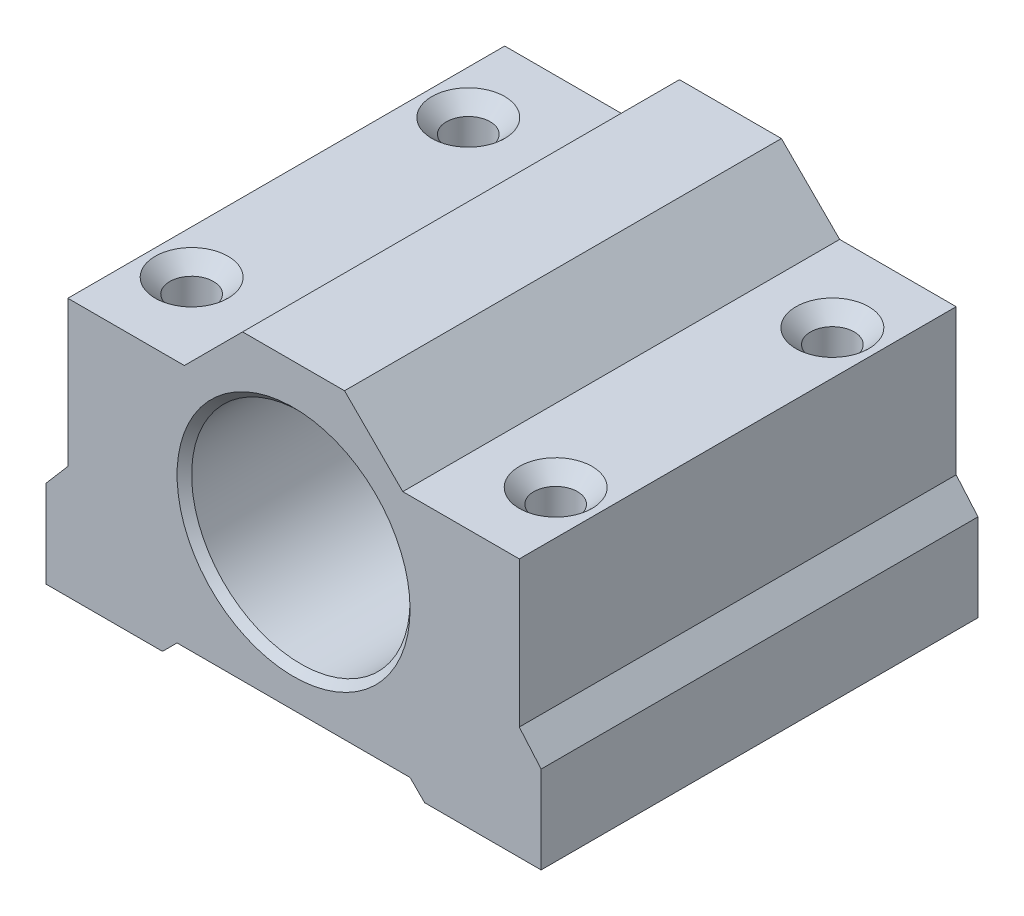
ISO-10303-21;
HEADER;
FILE_DESCRIPTION(('STEP AP214'),'2;1');
FILE_NAME('part.step','',(''),(''),'','','');
FILE_SCHEMA(('AUTOMOTIVE_DESIGN { 1 0 10303 214 1 1 1 1 }'));
ENDSEC;
DATA;
#1=APPLICATION_CONTEXT('core data for automotive mechanical design processes');
#2=APPLICATION_PROTOCOL_DEFINITION('international standard','automotive_design',2000,#1);
#3=PRODUCT_CONTEXT('',#1,'mechanical');
#4=PRODUCT('Part','Part','',(#3));
#5=PRODUCT_RELATED_PRODUCT_CATEGORY('part','',(#4));
#6=PRODUCT_DEFINITION_FORMATION('','',#4);
#7=PRODUCT_DEFINITION_CONTEXT('part definition',#1,'design');
#8=PRODUCT_DEFINITION('design','',#6,#7);
#9=PRODUCT_DEFINITION_SHAPE('','',#8);
#10=(LENGTH_UNIT() NAMED_UNIT(*) SI_UNIT(.MILLI.,.METRE.));
#11=(NAMED_UNIT(*) PLANE_ANGLE_UNIT() SI_UNIT($,.RADIAN.));
#12=(NAMED_UNIT(*) SI_UNIT($,.STERADIAN.) SOLID_ANGLE_UNIT());
#13=UNCERTAINTY_MEASURE_WITH_UNIT(LENGTH_MEASURE(1.E-05),#10,'distance_accuracy_value','');
#14=(GEOMETRIC_REPRESENTATION_CONTEXT(3) GLOBAL_UNCERTAINTY_ASSIGNED_CONTEXT((#13)) GLOBAL_UNIT_ASSIGNED_CONTEXT((#10,
#11,#12)) REPRESENTATION_CONTEXT('',''));
#15=CARTESIAN_POINT('',(0.,0.,0.));
#16=DIRECTION('',(0.,0.,1.));
#17=DIRECTION('',(1.,0.,0.));
#18=AXIS2_PLACEMENT_3D('',#15,#16,#17);
#19=CARTESIAN_POINT('',(0.,-3.33066907387547E-13,30.));
#20=DIRECTION('',(0.,0.,-0.999999999999999));
#21=DIRECTION('',(-1.,0.,0.));
#22=AXIS2_PLACEMENT_3D('',#19,#20,#21);
#23=PLANE('',#22);
#24=DIRECTION('',(1.,0.,0.));
#25=VECTOR('',#24,1.);
#26=CARTESIAN_POINT('',(8.00000000000017,0.,30.));
#27=LINE('',#26,#25);
#28=CARTESIAN_POINT('',(0.,-3.33066907387547E-13,30.));
#29=VERTEX_POINT('',#28);
#30=CARTESIAN_POINT('',(8.00000000000017,0.,30.));
#31=VERTEX_POINT('',#30);
#32=EDGE_CURVE('E230',#29,#31,#27,.T.);
#33=ORIENTED_EDGE('',*,*,#32,.T.);
#34=DIRECTION('',(0.707106781186546,0.70710678118655,0.));
#35=VECTOR('',#34,1.);
#36=CARTESIAN_POINT('',(9.00000000000017,0.999999999999834,30.));
#37=LINE('',#36,#35);
#38=CARTESIAN_POINT('',(9.00000000000017,0.999999999999834,30.));
#39=VERTEX_POINT('',#38);
#40=EDGE_CURVE('E138',#31,#39,#37,.T.);
#41=ORIENTED_EDGE('',*,*,#40,.T.);
#42=DIRECTION('',(1.,0.,0.));
#43=VECTOR('',#42,1.);
#44=CARTESIAN_POINT('',(25.0000000000001,0.999999999999945,30.));
#45=LINE('',#44,#43);
#46=CARTESIAN_POINT('',(25.0000000000001,0.999999999999945,30.));
#47=VERTEX_POINT('',#46);
#48=EDGE_CURVE('E269',#39,#47,#45,.T.);
#49=ORIENTED_EDGE('',*,*,#48,.T.);
#50=DIRECTION('',(0.707106781186547,-0.70710678118655,0.));
#51=VECTOR('',#50,1.);
#52=CARTESIAN_POINT('',(25.0000000000001,0.999999999999945,30.));
#53=LINE('',#52,#51);
#54=CARTESIAN_POINT('',(26.0000000000001,0.,30.));
#55=VERTEX_POINT('',#54);
#56=EDGE_CURVE('E287',#47,#55,#53,.T.);
#57=ORIENTED_EDGE('',*,*,#56,.T.);
#58=DIRECTION('',(1.,0.,0.));
#59=VECTOR('',#58,1.);
#60=CARTESIAN_POINT('',(26.0000000000001,0.,30.));
#61=LINE('',#60,#59);
#62=CARTESIAN_POINT('',(33.9999999999999,0.,30.));
#63=VERTEX_POINT('',#62);
#64=EDGE_CURVE('E284',#55,#63,#61,.T.);
#65=ORIENTED_EDGE('',*,*,#64,.T.);
#66=DIRECTION('',(0.,1.,0.));
#67=VECTOR('',#66,1.);
#68=CARTESIAN_POINT('',(33.9999999999999,0.,30.));
#69=LINE('',#68,#67);
#70=CARTESIAN_POINT('',(34.,6.00000000000006,30.));
#71=VERTEX_POINT('',#70);
#72=EDGE_CURVE('E286',#63,#71,#69,.T.);
#73=ORIENTED_EDGE('',*,*,#72,.T.);
#74=DIRECTION('',(-0.650791373455968,0.759256602365299,0.));
#75=VECTOR('',#74,1.);
#76=CARTESIAN_POINT('',(34.,6.00000000000006,30.));
#77=LINE('',#76,#75);
#78=CARTESIAN_POINT('',(32.5000000000001,7.7499999999997,30.));
#79=VERTEX_POINT('',#78);
#80=EDGE_CURVE('E289',#71,#79,#77,.T.);
#81=ORIENTED_EDGE('',*,*,#80,.T.);
#82=DIRECTION('',(0.,1.,0.));
#83=VECTOR('',#82,1.);
#84=CARTESIAN_POINT('',(32.5000000000001,7.7499999999997,30.));
#85=LINE('',#84,#83);
#86=CARTESIAN_POINT('',(32.5,17.7499999999999,30.));
#87=VERTEX_POINT('',#86);
#88=EDGE_CURVE('E295',#79,#87,#85,.T.);
#89=ORIENTED_EDGE('',*,*,#88,.T.);
#90=DIRECTION('',(-1.,0.,0.));
#91=VECTOR('',#90,1.);
#92=CARTESIAN_POINT('',(32.5,17.7499999999999,30.));
#93=LINE('',#92,#91);
#94=CARTESIAN_POINT('',(24.5000000000001,17.7500000000001,30.));
#95=VERTEX_POINT('',#94);
#96=EDGE_CURVE('E297',#87,#95,#93,.T.);
#97=ORIENTED_EDGE('',*,*,#96,.T.);
#98=DIRECTION('',(-0.707106781186549,0.707106781186547,0.));
#99=VECTOR('',#98,1.);
#100=CARTESIAN_POINT('',(24.5000000000001,17.7500000000001,30.));
#101=LINE('',#100,#99);
#102=CARTESIAN_POINT('',(20.5000000000002,21.7499999999997,30.));
#103=VERTEX_POINT('',#102);
#104=EDGE_CURVE('E299',#95,#103,#101,.T.);
#105=ORIENTED_EDGE('',*,*,#104,.T.);
#106=DIRECTION('',(-1.,0.,0.));
#107=VECTOR('',#106,1.);
#108=CARTESIAN_POINT('',(13.5000000000001,21.7499999999999,30.));
#109=LINE('',#108,#107);
#110=CARTESIAN_POINT('',(13.5000000000001,21.7499999999999,30.));
#111=VERTEX_POINT('',#110);
#112=EDGE_CURVE('E301',#103,#111,#109,.T.);
#113=ORIENTED_EDGE('',*,*,#112,.T.);
#114=DIRECTION('',(-0.707106781186549,-0.707106781186548,0.));
#115=VECTOR('',#114,1.);
#116=CARTESIAN_POINT('',(9.50000000000006,17.7500000000001,30.));
#117=LINE('',#116,#115);
#118=CARTESIAN_POINT('',(9.50000000000006,17.7500000000001,30.));
#119=VERTEX_POINT('',#118);
#120=EDGE_CURVE('E303',#111,#119,#117,.T.);
#121=ORIENTED_EDGE('',*,*,#120,.T.);
#122=DIRECTION('',(-1.,0.,0.));
#123=VECTOR('',#122,1.);
#124=CARTESIAN_POINT('',(1.5000000000001,17.7499999999999,30.));
#125=LINE('',#124,#123);
#126=CARTESIAN_POINT('',(1.5000000000001,17.7499999999999,30.));
#127=VERTEX_POINT('',#126);
#128=EDGE_CURVE('E181',#119,#127,#125,.T.);
#129=ORIENTED_EDGE('',*,*,#128,.T.);
#130=DIRECTION('',(0.,-1.,0.));
#131=VECTOR('',#130,1.);
#132=CARTESIAN_POINT('',(1.50000000000005,7.74999999999998,30.));
#133=LINE('',#132,#131);
#134=CARTESIAN_POINT('',(1.50000000000005,7.74999999999998,30.));
#135=VERTEX_POINT('',#134);
#136=EDGE_CURVE('E175',#127,#135,#133,.T.);
#137=ORIENTED_EDGE('',*,*,#136,.T.);
#138=DIRECTION('',(-0.650791373455969,-0.759256602365298,0.));
#139=VECTOR('',#138,1.);
#140=CARTESIAN_POINT('',(1.04083408558608E-13,5.99999999999989,30.));
#141=LINE('',#140,#139);
#142=CARTESIAN_POINT('',(1.04083408558608E-13,5.99999999999989,30.));
#143=VERTEX_POINT('',#142);
#144=EDGE_CURVE('E179',#135,#143,#141,.T.);
#145=ORIENTED_EDGE('',*,*,#144,.T.);
#146=DIRECTION('',(0.,-1.,0.));
#147=VECTOR('',#146,1.);
#148=CARTESIAN_POINT('',(0.,-3.33066907387547E-13,30.));
#149=LINE('',#148,#147);
#150=EDGE_CURVE('E71',#143,#29,#149,.T.);
#151=ORIENTED_EDGE('',*,*,#150,.T.);
#152=EDGE_LOOP('',(#33,#41,#49,#57,#65,#73,#81,#89,#97,#105,#113,#121,#129,#137,#145,#151));
#153=FACE_BOUND('',#152,.T.);
#154=CARTESIAN_POINT('',(17.0000000000001,10.9999999999997,30.));
#155=DIRECTION('',(0.,0.,0.999999999999999));
#156=DIRECTION('',(1.,0.,0.));
#157=AXIS2_PLACEMENT_3D('',#154,#155,#156);
#158=CIRCLE('',#157,8.);
#159=CARTESIAN_POINT('',(25.0000000000001,10.9999999999997,30.));
#160=VERTEX_POINT('',#159);
#161=EDGE_CURVE('E451',#160,#160,#158,.T.);
#162=ORIENTED_EDGE('',*,*,#161,.F.);
#163=EDGE_LOOP('',(#162));
#164=FACE_BOUND('',#163,.T.);
#165=ADVANCED_FACE('F54',(#153,#164),#23,.F.);
#166=CARTESIAN_POINT('',(8.00000000000017,0.,30.));
#167=DIRECTION('',(0.,1.,0.));
#168=DIRECTION('',(-1.,0.,0.));
#169=AXIS2_PLACEMENT_3D('',#166,#167,#168);
#170=PLANE('',#169);
#171=CARTESIAN_POINT('',(4.50000000000006,1.66533453693773E-13,5.50000000000001));
#172=DIRECTION('',(0.,-1.,0.));
#173=DIRECTION('',(0.,0.,-0.999999999999999));
#174=AXIS2_PLACEMENT_3D('',#171,#172,#173);
#175=CIRCLE('',#174,2.5);
#176=CARTESIAN_POINT('',(4.50000000000006,1.66533453693773E-13,3.00000000000001));
#177=VERTEX_POINT('',#176);
#178=EDGE_CURVE('E402',#177,#177,#175,.T.);
#179=ORIENTED_EDGE('',*,*,#178,.F.);
#180=EDGE_LOOP('',(#179));
#181=FACE_BOUND('',#180,.T.);
#182=CARTESIAN_POINT('',(4.50000000000011,0.,24.5));
#183=DIRECTION('',(0.,-1.,0.));
#184=DIRECTION('',(0.,0.,-0.999999999999999));
#185=AXIS2_PLACEMENT_3D('',#182,#183,#184);
#186=CIRCLE('',#185,2.5);
#187=CARTESIAN_POINT('',(4.50000000000011,0.,22.));
#188=VERTEX_POINT('',#187);
#189=EDGE_CURVE('E415',#188,#188,#186,.T.);
#190=ORIENTED_EDGE('',*,*,#189,.F.);
#191=EDGE_LOOP('',(#190));
#192=FACE_BOUND('',#191,.T.);
#193=DIRECTION('',(1.,0.,0.));
#194=VECTOR('',#193,1.);
#195=CARTESIAN_POINT('',(8.00000000000012,2.77555756156289E-13,0.));
#196=LINE('',#195,#194);
#197=CARTESIAN_POINT('',(0.,0.,0.));
#198=VERTEX_POINT('',#197);
#199=CARTESIAN_POINT('',(8.00000000000012,2.77555756156289E-13,0.));
#200=VERTEX_POINT('',#199);
#201=EDGE_CURVE('E199',#198,#200,#196,.T.);
#202=ORIENTED_EDGE('',*,*,#201,.T.);
#203=DIRECTION('',(0.,0.,-0.999999999999999));
#204=VECTOR('',#203,1.);
#205=CARTESIAN_POINT('',(8.00000000000017,0.,30.));
#206=LINE('',#205,#204);
#207=EDGE_CURVE('E13',#31,#200,#206,.T.);
#208=ORIENTED_EDGE('',*,*,#207,.F.);
#209=ORIENTED_EDGE('',*,*,#32,.F.);
#210=DIRECTION('',(0.,0.,-0.999999999999999));
#211=VECTOR('',#210,1.);
#212=CARTESIAN_POINT('',(0.,-3.33066907387547E-13,30.));
#213=LINE('',#212,#211);
#214=EDGE_CURVE('E195',#29,#198,#213,.T.);
#215=ORIENTED_EDGE('',*,*,#214,.T.);
#216=EDGE_LOOP('',(#202,#208,#209,#215));
#217=FACE_BOUND('',#216,.T.);
#218=ADVANCED_FACE('F56',(#181,#192,#217),#170,.F.);
#219=CARTESIAN_POINT('',(9.00000000000017,0.999999999999834,30.));
#220=DIRECTION('',(-0.70710678118655,0.707106781186546,0.));
#221=DIRECTION('',(-0.707106781186546,-0.70710678118655,0.));
#222=AXIS2_PLACEMENT_3D('',#219,#220,#221);
#223=PLANE('',#222);
#224=DIRECTION('',(0.707106781186546,0.70710678118655,0.));
#225=VECTOR('',#224,1.);
#226=CARTESIAN_POINT('',(9.00000000000011,1.00000000000017,0.));
#227=LINE('',#226,#225);
#228=CARTESIAN_POINT('',(9.00000000000011,1.00000000000017,0.));
#229=VERTEX_POINT('',#228);
#230=EDGE_CURVE('E202',#200,#229,#227,.T.);
#231=ORIENTED_EDGE('',*,*,#230,.T.);
#232=DIRECTION('',(0.,0.,-0.999999999999999));
#233=VECTOR('',#232,1.);
#234=CARTESIAN_POINT('',(9.00000000000017,0.999999999999834,30.));
#235=LINE('',#234,#233);
#236=EDGE_CURVE('E63',#39,#229,#235,.T.);
#237=ORIENTED_EDGE('',*,*,#236,.F.);
#238=ORIENTED_EDGE('',*,*,#40,.F.);
#239=ORIENTED_EDGE('',*,*,#207,.T.);
#240=EDGE_LOOP('',(#231,#237,#238,#239));
#241=FACE_BOUND('',#240,.T.);
#242=ADVANCED_FACE('F333',(#241),#223,.F.);
#243=CARTESIAN_POINT('',(25.0000000000001,0.999999999999945,30.));
#244=DIRECTION('',(0.,1.,0.));
#245=DIRECTION('',(-1.,0.,0.));
#246=AXIS2_PLACEMENT_3D('',#243,#244,#245);
#247=PLANE('',#246);
#248=DIRECTION('',(1.,0.,0.));
#249=VECTOR('',#248,1.);
#250=CARTESIAN_POINT('',(25.0000000000003,1.00000000000022,0.));
#251=LINE('',#250,#249);
#252=CARTESIAN_POINT('',(25.0000000000003,1.00000000000022,0.));
#253=VERTEX_POINT('',#252);
#254=EDGE_CURVE('E205',#229,#253,#251,.T.);
#255=ORIENTED_EDGE('',*,*,#254,.T.);
#256=DIRECTION('',(0.,0.,-0.999999999999999));
#257=VECTOR('',#256,1.);
#258=CARTESIAN_POINT('',(25.0000000000001,0.999999999999945,30.));
#259=LINE('',#258,#257);
#260=EDGE_CURVE('E261',#47,#253,#259,.T.);
#261=ORIENTED_EDGE('',*,*,#260,.F.);
#262=ORIENTED_EDGE('',*,*,#48,.F.);
#263=ORIENTED_EDGE('',*,*,#236,.T.);
#264=EDGE_LOOP('',(#255,#261,#262,#263));
#265=FACE_BOUND('',#264,.T.);
#266=ADVANCED_FACE('F267',(#265),#247,.F.);
#267=CARTESIAN_POINT('',(25.0000000000001,0.999999999999945,30.));
#268=DIRECTION('',(0.70710678118655,0.707106781186547,0.));
#269=DIRECTION('',(-0.707106781186547,0.70710678118655,0.));
#270=AXIS2_PLACEMENT_3D('',#267,#268,#269);
#271=PLANE('',#270);
#272=DIRECTION('',(0.707106781186547,-0.70710678118655,0.));
#273=VECTOR('',#272,1.);
#274=CARTESIAN_POINT('',(25.0000000000003,1.00000000000022,0.));
#275=LINE('',#274,#273);
#276=CARTESIAN_POINT('',(26.0000000000004,0.,0.));
#277=VERTEX_POINT('',#276);
#278=EDGE_CURVE('E207',#253,#277,#275,.T.);
#279=ORIENTED_EDGE('',*,*,#278,.T.);
#280=DIRECTION('',(0.,0.,-0.999999999999999));
#281=VECTOR('',#280,1.);
#282=CARTESIAN_POINT('',(26.0000000000001,0.,30.));
#283=LINE('',#282,#281);
#284=EDGE_CURVE('E258',#55,#277,#283,.T.);
#285=ORIENTED_EDGE('',*,*,#284,.F.);
#286=ORIENTED_EDGE('',*,*,#56,.F.);
#287=ORIENTED_EDGE('',*,*,#260,.T.);
#288=EDGE_LOOP('',(#279,#285,#286,#287));
#289=FACE_BOUND('',#288,.T.);
#290=ADVANCED_FACE('F278',(#289),#271,.F.);
#291=CARTESIAN_POINT('',(26.0000000000001,0.,30.));
#292=DIRECTION('',(0.,1.,0.));
#293=DIRECTION('',(-1.,0.,0.));
#294=AXIS2_PLACEMENT_3D('',#291,#292,#293);
#295=PLANE('',#294);
#296=CARTESIAN_POINT('',(29.5000000000001,3.88578058618805E-13,5.50000000000001));
#297=DIRECTION('',(0.,-1.,0.));
#298=DIRECTION('',(0.,0.,-0.999999999999999));
#299=AXIS2_PLACEMENT_3D('',#296,#297,#298);
#300=CIRCLE('',#299,2.5);
#301=CARTESIAN_POINT('',(29.5000000000001,3.88578058618805E-13,3.00000000000001));
#302=VERTEX_POINT('',#301);
#303=EDGE_CURVE('E427',#302,#302,#300,.T.);
#304=ORIENTED_EDGE('',*,*,#303,.F.);
#305=EDGE_LOOP('',(#304));
#306=FACE_BOUND('',#305,.T.);
#307=CARTESIAN_POINT('',(29.5,0.,24.5));
#308=DIRECTION('',(0.,-1.,0.));
#309=DIRECTION('',(0.,0.,-0.999999999999999));
#310=AXIS2_PLACEMENT_3D('',#307,#308,#309);
#311=CIRCLE('',#310,2.5);
#312=CARTESIAN_POINT('',(29.5,0.,22.));
#313=VERTEX_POINT('',#312);
#314=EDGE_CURVE('E439',#313,#313,#311,.T.);
#315=ORIENTED_EDGE('',*,*,#314,.F.);
#316=EDGE_LOOP('',(#315));
#317=FACE_BOUND('',#316,.T.);
#318=DIRECTION('',(1.,0.,0.));
#319=VECTOR('',#318,1.);
#320=CARTESIAN_POINT('',(26.0000000000004,0.,0.));
#321=LINE('',#320,#319);
#322=CARTESIAN_POINT('',(33.9999999999999,2.77555756156289E-13,0.));
#323=VERTEX_POINT('',#322);
#324=EDGE_CURVE('E209',#277,#323,#321,.T.);
#325=ORIENTED_EDGE('',*,*,#324,.T.);
#326=DIRECTION('',(0.,0.,-0.999999999999999));
#327=VECTOR('',#326,1.);
#328=CARTESIAN_POINT('',(33.9999999999999,0.,30.));
#329=LINE('',#328,#327);
#330=EDGE_CURVE('E255',#63,#323,#329,.T.);
#331=ORIENTED_EDGE('',*,*,#330,.F.);
#332=ORIENTED_EDGE('',*,*,#64,.F.);
#333=ORIENTED_EDGE('',*,*,#284,.T.);
#334=EDGE_LOOP('',(#325,#331,#332,#333));
#335=FACE_BOUND('',#334,.T.);
#336=ADVANCED_FACE('F282',(#306,#317,#335),#295,.F.);
#337=CARTESIAN_POINT('',(33.9999999999999,0.,30.));
#338=DIRECTION('',(-1.,0.,0.));
#339=DIRECTION('',(0.,-1.,0.));
#340=AXIS2_PLACEMENT_3D('',#337,#338,#339);
#341=PLANE('',#340);
#342=DIRECTION('',(0.,1.,0.));
#343=VECTOR('',#342,1.);
#344=CARTESIAN_POINT('',(33.9999999999999,2.77555756156289E-13,0.));
#345=LINE('',#344,#343);
#346=CARTESIAN_POINT('',(34.,6.00000000000028,0.));
#347=VERTEX_POINT('',#346);
#348=EDGE_CURVE('E211',#323,#347,#345,.T.);
#349=ORIENTED_EDGE('',*,*,#348,.T.);
#350=DIRECTION('',(0.,0.,-0.999999999999999));
#351=VECTOR('',#350,1.);
#352=CARTESIAN_POINT('',(34.,6.00000000000006,30.));
#353=LINE('',#352,#351);
#354=EDGE_CURVE('E252',#71,#347,#353,.T.);
#355=ORIENTED_EDGE('',*,*,#354,.F.);
#356=ORIENTED_EDGE('',*,*,#72,.F.);
#357=ORIENTED_EDGE('',*,*,#330,.T.);
#358=EDGE_LOOP('',(#349,#355,#356,#357));
#359=FACE_BOUND('',#358,.T.);
#360=ADVANCED_FACE('F475',(#359),#341,.F.);
#361=CARTESIAN_POINT('',(34.,6.00000000000006,30.));
#362=DIRECTION('',(-0.759256602365299,-0.650791373455968,0.));
#363=DIRECTION('',(0.650791373455968,-0.759256602365299,0.));
#364=AXIS2_PLACEMENT_3D('',#361,#362,#363);
#365=PLANE('',#364);
#366=DIRECTION('',(-0.650791373455968,0.759256602365299,0.));
#367=VECTOR('',#366,1.);
#368=CARTESIAN_POINT('',(34.,6.00000000000028,0.));
#369=LINE('',#368,#367);
#370=CARTESIAN_POINT('',(32.5,7.75000000000003,0.));
#371=VERTEX_POINT('',#370);
#372=EDGE_CURVE('E213',#347,#371,#369,.T.);
#373=ORIENTED_EDGE('',*,*,#372,.T.);
#374=DIRECTION('',(0.,0.,-0.999999999999999));
#375=VECTOR('',#374,1.);
#376=CARTESIAN_POINT('',(32.5000000000001,7.7499999999997,30.));
#377=LINE('',#376,#375);
#378=EDGE_CURVE('E249',#79,#371,#377,.T.);
#379=ORIENTED_EDGE('',*,*,#378,.F.);
#380=ORIENTED_EDGE('',*,*,#80,.F.);
#381=ORIENTED_EDGE('',*,*,#354,.T.);
#382=EDGE_LOOP('',(#373,#379,#380,#381));
#383=FACE_BOUND('',#382,.T.);
#384=ADVANCED_FACE('F482',(#383),#365,.F.);
#385=CARTESIAN_POINT('',(32.5000000000001,7.7499999999997,30.));
#386=DIRECTION('',(-1.,0.,0.));
#387=DIRECTION('',(0.,-1.,0.));
#388=AXIS2_PLACEMENT_3D('',#385,#386,#387);
#389=PLANE('',#388);
#390=DIRECTION('',(0.,1.,0.));
#391=VECTOR('',#390,1.);
#392=CARTESIAN_POINT('',(32.5,7.75000000000003,0.));
#393=LINE('',#392,#391);
#394=CARTESIAN_POINT('',(32.4999999999999,17.7500000000002,0.));
#395=VERTEX_POINT('',#394);
#396=EDGE_CURVE('E215',#371,#395,#393,.T.);
#397=ORIENTED_EDGE('',*,*,#396,.T.);
#398=DIRECTION('',(0.,0.,-0.999999999999999));
#399=VECTOR('',#398,1.);
#400=CARTESIAN_POINT('',(32.5,17.7499999999999,30.));
#401=LINE('',#400,#399);
#402=EDGE_CURVE('E246',#87,#395,#401,.T.);
#403=ORIENTED_EDGE('',*,*,#402,.F.);
#404=ORIENTED_EDGE('',*,*,#88,.F.);
#405=ORIENTED_EDGE('',*,*,#378,.T.);
#406=EDGE_LOOP('',(#397,#403,#404,#405));
#407=FACE_BOUND('',#406,.T.);
#408=ADVANCED_FACE('F516',(#407),#389,.F.);
#409=CARTESIAN_POINT('',(32.5,17.7499999999999,30.));
#410=DIRECTION('',(0.,-1.,0.));
#411=DIRECTION('',(0.,0.,-0.999999999999999));
#412=AXIS2_PLACEMENT_3D('',#409,#410,#411);
#413=PLANE('',#412);
#414=CARTESIAN_POINT('',(29.5000000000001,17.7500000000003,5.50000000000001));
#415=DIRECTION('',(0.,-1.,0.));
#416=DIRECTION('',(0.,0.,-0.999999999999999));
#417=AXIS2_PLACEMENT_3D('',#414,#415,#416);
#418=CIRCLE('',#417,2.5);
#419=CARTESIAN_POINT('',(29.5000000000001,17.7500000000003,3.00000000000001));
#420=VERTEX_POINT('',#419);
#421=EDGE_CURVE('E424',#420,#420,#418,.T.);
#422=ORIENTED_EDGE('',*,*,#421,.T.);
#423=EDGE_LOOP('',(#422));
#424=FACE_BOUND('',#423,.T.);
#425=CARTESIAN_POINT('',(29.5000000000001,17.75,24.5));
#426=DIRECTION('',(0.,-1.,0.));
#427=DIRECTION('',(0.,0.,-0.999999999999999));
#428=AXIS2_PLACEMENT_3D('',#425,#426,#427);
#429=CIRCLE('',#428,2.5);
#430=CARTESIAN_POINT('',(29.5000000000001,17.75,22.));
#431=VERTEX_POINT('',#430);
#432=EDGE_CURVE('E436',#431,#431,#429,.T.);
#433=ORIENTED_EDGE('',*,*,#432,.T.);
#434=EDGE_LOOP('',(#433));
#435=FACE_BOUND('',#434,.T.);
#436=DIRECTION('',(-1.,0.,0.));
#437=VECTOR('',#436,1.);
#438=CARTESIAN_POINT('',(32.4999999999999,17.7500000000002,0.));
#439=LINE('',#438,#437);
#440=CARTESIAN_POINT('',(24.5000000000001,17.7500000000004,0.));
#441=VERTEX_POINT('',#440);
#442=EDGE_CURVE('E217',#395,#441,#439,.T.);
#443=ORIENTED_EDGE('',*,*,#442,.T.);
#444=DIRECTION('',(0.,0.,-0.999999999999999));
#445=VECTOR('',#444,1.);
#446=CARTESIAN_POINT('',(24.5000000000001,17.7500000000001,30.));
#447=LINE('',#446,#445);
#448=EDGE_CURVE('E243',#95,#441,#447,.T.);
#449=ORIENTED_EDGE('',*,*,#448,.F.);
#450=ORIENTED_EDGE('',*,*,#96,.F.);
#451=ORIENTED_EDGE('',*,*,#402,.T.);
#452=EDGE_LOOP('',(#443,#449,#450,#451));
#453=FACE_BOUND('',#452,.T.);
#454=ADVANCED_FACE('F523',(#424,#435,#453),#413,.F.);
#455=CARTESIAN_POINT('',(24.5000000000001,17.7500000000001,30.));
#456=DIRECTION('',(-0.707106781186547,-0.707106781186549,0.));
#457=DIRECTION('',(0.707106781186549,-0.707106781186547,0.));
#458=AXIS2_PLACEMENT_3D('',#455,#456,#457);
#459=PLANE('',#458);
#460=DIRECTION('',(-0.707106781186549,0.707106781186547,0.));
#461=VECTOR('',#460,1.);
#462=CARTESIAN_POINT('',(24.5000000000001,17.7500000000004,0.));
#463=LINE('',#462,#461);
#464=CARTESIAN_POINT('',(20.5000000000003,21.7500000000002,0.));
#465=VERTEX_POINT('',#464);
#466=EDGE_CURVE('E219',#441,#465,#463,.T.);
#467=ORIENTED_EDGE('',*,*,#466,.T.);
#468=DIRECTION('',(0.,0.,-0.999999999999999));
#469=VECTOR('',#468,1.);
#470=CARTESIAN_POINT('',(20.5000000000002,21.7499999999997,30.));
#471=LINE('',#470,#469);
#472=EDGE_CURVE('E240',#103,#465,#471,.T.);
#473=ORIENTED_EDGE('',*,*,#472,.F.);
#474=ORIENTED_EDGE('',*,*,#104,.F.);
#475=ORIENTED_EDGE('',*,*,#448,.T.);
#476=EDGE_LOOP('',(#467,#473,#474,#475));
#477=FACE_BOUND('',#476,.T.);
#478=ADVANCED_FACE('F531',(#477),#459,.F.);
#479=CARTESIAN_POINT('',(13.5000000000001,21.7499999999999,30.));
#480=DIRECTION('',(0.,-1.,0.));
#481=DIRECTION('',(0.,0.,-0.999999999999999));
#482=AXIS2_PLACEMENT_3D('',#479,#480,#481);
#483=PLANE('',#482);
#484=DIRECTION('',(-1.,0.,0.));
#485=VECTOR('',#484,1.);
#486=CARTESIAN_POINT('',(13.5000000000002,21.7500000000003,0.));
#487=LINE('',#486,#485);
#488=CARTESIAN_POINT('',(13.5000000000002,21.7500000000003,0.));
#489=VERTEX_POINT('',#488);
#490=EDGE_CURVE('E221',#465,#489,#487,.T.);
#491=ORIENTED_EDGE('',*,*,#490,.T.);
#492=DIRECTION('',(0.,0.,-0.999999999999999));
#493=VECTOR('',#492,1.);
#494=CARTESIAN_POINT('',(13.5000000000001,21.7499999999999,30.));
#495=LINE('',#494,#493);
#496=EDGE_CURVE('E237',#111,#489,#495,.T.);
#497=ORIENTED_EDGE('',*,*,#496,.F.);
#498=ORIENTED_EDGE('',*,*,#112,.F.);
#499=ORIENTED_EDGE('',*,*,#472,.T.);
#500=EDGE_LOOP('',(#491,#497,#498,#499));
#501=FACE_BOUND('',#500,.T.);
#502=ADVANCED_FACE('F539',(#501),#483,.F.);
#503=CARTESIAN_POINT('',(9.50000000000006,17.7500000000001,30.));
#504=DIRECTION('',(0.707106781186548,-0.707106781186549,0.));
#505=DIRECTION('',(0.707106781186549,0.707106781186548,0.));
#506=AXIS2_PLACEMENT_3D('',#503,#504,#505);
#507=PLANE('',#506);
#508=DIRECTION('',(-0.707106781186549,-0.707106781186548,0.));
#509=VECTOR('',#508,1.);
#510=CARTESIAN_POINT('',(9.50000000000006,17.7500000000004,0.));
#511=LINE('',#510,#509);
#512=CARTESIAN_POINT('',(9.50000000000006,17.7500000000004,0.));
#513=VERTEX_POINT('',#512);
#514=EDGE_CURVE('E223',#489,#513,#511,.T.);
#515=ORIENTED_EDGE('',*,*,#514,.T.);
#516=DIRECTION('',(0.,0.,-0.999999999999999));
#517=VECTOR('',#516,1.);
#518=CARTESIAN_POINT('',(9.50000000000006,17.7500000000001,30.));
#519=LINE('',#518,#517);
#520=EDGE_CURVE('E234',#119,#513,#519,.T.);
#521=ORIENTED_EDGE('',*,*,#520,.F.);
#522=ORIENTED_EDGE('',*,*,#120,.F.);
#523=ORIENTED_EDGE('',*,*,#496,.T.);
#524=EDGE_LOOP('',(#515,#521,#522,#523));
#525=FACE_BOUND('',#524,.T.);
#526=ADVANCED_FACE('F309',(#525),#507,.F.);
#527=CARTESIAN_POINT('',(1.5000000000001,17.7499999999999,30.));
#528=DIRECTION('',(0.,-1.,0.));
#529=DIRECTION('',(0.,0.,-0.999999999999999));
#530=AXIS2_PLACEMENT_3D('',#527,#528,#529);
#531=PLANE('',#530);
#532=CARTESIAN_POINT('',(4.5,17.7500000000003,5.50000000000001));
#533=DIRECTION('',(0.,-1.,0.));
#534=DIRECTION('',(0.,0.,-0.999999999999999));
#535=AXIS2_PLACEMENT_3D('',#532,#533,#534);
#536=CIRCLE('',#535,2.5);
#537=CARTESIAN_POINT('',(4.5,17.7500000000003,3.00000000000001));
#538=VERTEX_POINT('',#537);
#539=EDGE_CURVE('E403',#538,#538,#536,.T.);
#540=ORIENTED_EDGE('',*,*,#539,.T.);
#541=EDGE_LOOP('',(#540));
#542=FACE_BOUND('',#541,.T.);
#543=CARTESIAN_POINT('',(4.49999999999994,17.75,24.5));
#544=DIRECTION('',(0.,-1.,0.));
#545=DIRECTION('',(0.,0.,-0.999999999999999));
#546=AXIS2_PLACEMENT_3D('',#543,#544,#545);
#547=CIRCLE('',#546,2.5);
#548=CARTESIAN_POINT('',(4.49999999999994,17.75,22.));
#549=VERTEX_POINT('',#548);
#550=EDGE_CURVE('E412',#549,#549,#547,.T.);
#551=ORIENTED_EDGE('',*,*,#550,.T.);
#552=EDGE_LOOP('',(#551));
#553=FACE_BOUND('',#552,.T.);
#554=DIRECTION('',(-1.,0.,0.));
#555=VECTOR('',#554,1.);
#556=CARTESIAN_POINT('',(1.50000000000022,17.7500000000002,0.));
#557=LINE('',#556,#555);
#558=CARTESIAN_POINT('',(1.50000000000022,17.7500000000002,0.));
#559=VERTEX_POINT('',#558);
#560=EDGE_CURVE('E225',#513,#559,#557,.T.);
#561=ORIENTED_EDGE('',*,*,#560,.T.);
#562=DIRECTION('',(0.,0.,-0.999999999999999));
#563=VECTOR('',#562,1.);
#564=CARTESIAN_POINT('',(1.5000000000001,17.7499999999999,30.));
#565=LINE('',#564,#563);
#566=EDGE_CURVE('E190',#127,#559,#565,.T.);
#567=ORIENTED_EDGE('',*,*,#566,.F.);
#568=ORIENTED_EDGE('',*,*,#128,.F.);
#569=ORIENTED_EDGE('',*,*,#520,.T.);
#570=EDGE_LOOP('',(#561,#567,#568,#569));
#571=FACE_BOUND('',#570,.T.);
#572=ADVANCED_FACE('F313',(#542,#553,#571),#531,.F.);
#573=CARTESIAN_POINT('',(1.50000000000005,7.74999999999998,30.));
#574=DIRECTION('',(1.,0.,0.));
#575=DIRECTION('',(0.,0.,-0.999999999999999));
#576=AXIS2_PLACEMENT_3D('',#573,#574,#575);
#577=PLANE('',#576);
#578=DIRECTION('',(0.,-1.,0.));
#579=VECTOR('',#578,1.);
#580=CARTESIAN_POINT('',(1.50000000000005,7.75000000000031,0.));
#581=LINE('',#580,#579);
#582=CARTESIAN_POINT('',(1.50000000000005,7.75000000000031,0.));
#583=VERTEX_POINT('',#582);
#584=EDGE_CURVE('E189',#559,#583,#581,.T.);
#585=ORIENTED_EDGE('',*,*,#584,.T.);
#586=DIRECTION('',(0.,0.,-0.999999999999999));
#587=VECTOR('',#586,1.);
#588=CARTESIAN_POINT('',(1.50000000000005,7.74999999999998,30.));
#589=LINE('',#588,#587);
#590=EDGE_CURVE('E186',#135,#583,#589,.T.);
#591=ORIENTED_EDGE('',*,*,#590,.F.);
#592=ORIENTED_EDGE('',*,*,#136,.F.);
#593=ORIENTED_EDGE('',*,*,#566,.T.);
#594=EDGE_LOOP('',(#585,#591,#592,#593));
#595=FACE_BOUND('',#594,.T.);
#596=ADVANCED_FACE('F187',(#595),#577,.F.);
#597=CARTESIAN_POINT('',(1.04083408558608E-13,5.99999999999989,30.));
#598=DIRECTION('',(0.759256602365298,-0.65079137345597,0.));
#599=DIRECTION('',(0.65079137345597,0.759256602365298,0.));
#600=AXIS2_PLACEMENT_3D('',#597,#598,#599);
#601=PLANE('',#600);
#602=DIRECTION('',(-0.650791373455969,-0.759256602365298,0.));
#603=VECTOR('',#602,1.);
#604=CARTESIAN_POINT('',(0.,6.00000000000001,0.));
#605=LINE('',#604,#603);
#606=CARTESIAN_POINT('',(0.,6.00000000000001,0.));
#607=VERTEX_POINT('',#606);
#608=EDGE_CURVE('E124',#583,#607,#605,.T.);
#609=ORIENTED_EDGE('',*,*,#608,.T.);
#610=DIRECTION('',(0.,0.,-0.999999999999999));
#611=VECTOR('',#610,1.);
#612=CARTESIAN_POINT('',(1.04083408558608E-13,5.99999999999989,30.));
#613=LINE('',#612,#611);
#614=EDGE_CURVE('E191',#143,#607,#613,.T.);
#615=ORIENTED_EDGE('',*,*,#614,.F.);
#616=ORIENTED_EDGE('',*,*,#144,.F.);
#617=ORIENTED_EDGE('',*,*,#590,.T.);
#618=EDGE_LOOP('',(#609,#615,#616,#617));
#619=FACE_BOUND('',#618,.T.);
#620=ADVANCED_FACE('F193',(#619),#601,.F.);
#621=CARTESIAN_POINT('',(0.,-3.33066907387547E-13,30.));
#622=DIRECTION('',(1.,0.,0.));
#623=DIRECTION('',(0.,0.,-0.999999999999999));
#624=AXIS2_PLACEMENT_3D('',#621,#622,#623);
#625=PLANE('',#624);
#626=DIRECTION('',(0.,-1.,0.));
#627=VECTOR('',#626,1.);
#628=CARTESIAN_POINT('',(0.,0.,0.));
#629=LINE('',#628,#627);
#630=EDGE_CURVE('E130',#607,#198,#629,.T.);
#631=ORIENTED_EDGE('',*,*,#630,.T.);
#632=ORIENTED_EDGE('',*,*,#214,.F.);
#633=ORIENTED_EDGE('',*,*,#150,.F.);
#634=ORIENTED_EDGE('',*,*,#614,.T.);
#635=EDGE_LOOP('',(#631,#632,#633,#634));
#636=FACE_BOUND('',#635,.T.);
#637=ADVANCED_FACE('F317',(#636),#625,.F.);
#638=CARTESIAN_POINT('',(0.,0.,0.));
#639=DIRECTION('',(0.,0.,-0.999999999999999));
#640=DIRECTION('',(-1.,0.,0.));
#641=AXIS2_PLACEMENT_3D('',#638,#639,#640);
#642=PLANE('',#641);
#643=CARTESIAN_POINT('',(17.,11.,0.));
#644=DIRECTION('',(0.,0.,0.999999999999999));
#645=DIRECTION('',(1.,0.,0.));
#646=AXIS2_PLACEMENT_3D('',#643,#644,#645);
#647=CIRCLE('',#646,7.74999999999999);
#648=CARTESIAN_POINT('',(24.75,11.,0.));
#649=VERTEX_POINT('',#648);
#650=EDGE_CURVE('E448',#649,#649,#647,.T.);
#651=ORIENTED_EDGE('',*,*,#650,.T.);
#652=EDGE_LOOP('',(#651));
#653=FACE_BOUND('',#652,.T.);
#654=ORIENTED_EDGE('',*,*,#201,.F.);
#655=ORIENTED_EDGE('',*,*,#630,.F.);
#656=ORIENTED_EDGE('',*,*,#608,.F.);
#657=ORIENTED_EDGE('',*,*,#584,.F.);
#658=ORIENTED_EDGE('',*,*,#560,.F.);
#659=ORIENTED_EDGE('',*,*,#514,.F.);
#660=ORIENTED_EDGE('',*,*,#490,.F.);
#661=ORIENTED_EDGE('',*,*,#466,.F.);
#662=ORIENTED_EDGE('',*,*,#442,.F.);
#663=ORIENTED_EDGE('',*,*,#396,.F.);
#664=ORIENTED_EDGE('',*,*,#372,.F.);
#665=ORIENTED_EDGE('',*,*,#348,.F.);
#666=ORIENTED_EDGE('',*,*,#324,.F.);
#667=ORIENTED_EDGE('',*,*,#278,.F.);
#668=ORIENTED_EDGE('',*,*,#254,.F.);
#669=ORIENTED_EDGE('',*,*,#230,.F.);
#670=EDGE_LOOP('',(#654,#655,#656,#657,#658,#659,#660,#661,#662,#663,#664,#665,#666,#667,#668,#669));
#671=FACE_BOUND('',#670,.T.);
#672=ADVANCED_FACE('F273',(#653,#671),#642,.T.);
#673=CARTESIAN_POINT('',(17.,11.,0.249999999999972));
#674=DIRECTION('',(0.,0.,-0.999999999999999));
#675=DIRECTION('',(-1.,0.,0.));
#676=AXIS2_PLACEMENT_3D('',#673,#674,#675);
#677=CONICAL_SURFACE('',#676,7.5,0.785398163397442);
#678=ORIENTED_EDGE('',*,*,#650,.F.);
#679=EDGE_LOOP('',(#678));
#680=FACE_BOUND('',#679,.T.);
#681=CARTESIAN_POINT('',(17.,11.,0.249999999999972));
#682=DIRECTION('',(0.,0.,0.999999999999999));
#683=DIRECTION('',(1.,0.,0.));
#684=AXIS2_PLACEMENT_3D('',#681,#682,#683);
#685=CIRCLE('',#684,7.5);
#686=CARTESIAN_POINT('',(24.5,11.,0.249999999999972));
#687=VERTEX_POINT('',#686);
#688=EDGE_CURVE('E203',#687,#687,#685,.T.);
#689=ORIENTED_EDGE('',*,*,#688,.T.);
#690=EDGE_LOOP('',(#689));
#691=FACE_BOUND('',#690,.T.);
#692=ADVANCED_FACE('F324',(#680,#691),#677,.F.);
#693=CARTESIAN_POINT('',(17.0000000000001,10.9999999999997,30.));
#694=DIRECTION('',(0.,0.,0.999999999999999));
#695=DIRECTION('',(1.,0.,0.));
#696=AXIS2_PLACEMENT_3D('',#693,#694,#695);
#697=CYLINDRICAL_SURFACE('',#696,7.5);
#698=ORIENTED_EDGE('',*,*,#688,.F.);
#699=EDGE_LOOP('',(#698));
#700=FACE_BOUND('',#699,.T.);
#701=CARTESIAN_POINT('',(17.0000000000001,10.9999999999997,29.5));
#702=DIRECTION('',(0.,0.,0.999999999999999));
#703=DIRECTION('',(1.,0.,0.));
#704=AXIS2_PLACEMENT_3D('',#701,#702,#703);
#705=CIRCLE('',#704,7.5);
#706=CARTESIAN_POINT('',(24.5000000000001,10.9999999999997,29.5));
#707=VERTEX_POINT('',#706);
#708=EDGE_CURVE('E454',#707,#707,#705,.T.);
#709=ORIENTED_EDGE('',*,*,#708,.T.);
#710=EDGE_LOOP('',(#709));
#711=FACE_BOUND('',#710,.T.);
#712=ADVANCED_FACE('F338',(#700,#711),#697,.F.);
#713=CARTESIAN_POINT('',(17.0000000000001,10.9999999999997,30.));
#714=DIRECTION('',(0.,0.,0.999999999999999));
#715=DIRECTION('',(1.,0.,0.));
#716=AXIS2_PLACEMENT_3D('',#713,#714,#715);
#717=CONICAL_SURFACE('',#716,8.,0.785398163397445);
#718=ORIENTED_EDGE('',*,*,#708,.F.);
#719=EDGE_LOOP('',(#718));
#720=FACE_BOUND('',#719,.T.);
#721=ORIENTED_EDGE('',*,*,#161,.T.);
#722=EDGE_LOOP('',(#721));
#723=FACE_BOUND('',#722,.T.);
#724=ADVANCED_FACE('F342',(#720,#723),#717,.F.);
#725=CARTESIAN_POINT('',(29.5,16.7499999999999,24.5));
#726=DIRECTION('',(0.,1.,0.));
#727=DIRECTION('',(0.,0.,0.999999999999999));
#728=AXIS2_PLACEMENT_3D('',#725,#726,#727);
#729=CONICAL_SURFACE('',#728,1.49999999999999,0.785398163397448);
#730=ORIENTED_EDGE('',*,*,#432,.F.);
#731=EDGE_LOOP('',(#730));
#732=FACE_BOUND('',#731,.T.);
#733=CARTESIAN_POINT('',(29.5,16.7499999999999,24.5));
#734=DIRECTION('',(0.,-1.,0.));
#735=DIRECTION('',(0.,0.,-0.999999999999999));
#736=AXIS2_PLACEMENT_3D('',#733,#734,#735);
#737=CIRCLE('',#736,1.49999999999999);
#738=CARTESIAN_POINT('',(29.5,16.7499999999999,23.));
#739=VERTEX_POINT('',#738);
#740=EDGE_CURVE('E445',#739,#739,#737,.T.);
#741=ORIENTED_EDGE('',*,*,#740,.T.);
#742=EDGE_LOOP('',(#741));
#743=FACE_BOUND('',#742,.T.);
#744=ADVANCED_FACE('F346',(#732,#743),#729,.F.);
#745=CARTESIAN_POINT('',(29.5,0.,24.5));
#746=DIRECTION('',(0.,-1.,0.));
#747=DIRECTION('',(0.,0.,-0.999999999999999));
#748=AXIS2_PLACEMENT_3D('',#745,#746,#747);
#749=CYLINDRICAL_SURFACE('',#748,1.49999999999999);
#750=ORIENTED_EDGE('',*,*,#740,.F.);
#751=EDGE_LOOP('',(#750));
#752=FACE_BOUND('',#751,.T.);
#753=CARTESIAN_POINT('',(29.5000000000004,0.99999999999989,24.5));
#754=DIRECTION('',(0.,-1.,0.));
#755=DIRECTION('',(0.,0.,-0.999999999999999));
#756=AXIS2_PLACEMENT_3D('',#753,#754,#755);
#757=CIRCLE('',#756,1.49999999999999);
#758=CARTESIAN_POINT('',(29.5000000000004,0.99999999999989,23.));
#759=VERTEX_POINT('',#758);
#760=EDGE_CURVE('E442',#759,#759,#757,.T.);
#761=ORIENTED_EDGE('',*,*,#760,.T.);
#762=EDGE_LOOP('',(#761));
#763=FACE_BOUND('',#762,.T.);
#764=ADVANCED_FACE('F350',(#752,#763),#749,.F.);
#765=CARTESIAN_POINT('',(29.5,0.,24.5));
#766=DIRECTION('',(0.,-1.,0.));
#767=DIRECTION('',(0.,0.,-0.999999999999999));
#768=AXIS2_PLACEMENT_3D('',#765,#766,#767);
#769=CONICAL_SURFACE('',#768,2.5,0.785398163397453);
#770=ORIENTED_EDGE('',*,*,#760,.F.);
#771=EDGE_LOOP('',(#770));
#772=FACE_BOUND('',#771,.T.);
#773=ORIENTED_EDGE('',*,*,#314,.T.);
#774=EDGE_LOOP('',(#773));
#775=FACE_BOUND('',#774,.T.);
#776=ADVANCED_FACE('F354',(#772,#775),#769,.F.);
#777=CARTESIAN_POINT('',(29.5,16.75,5.50000000000001));
#778=DIRECTION('',(0.,1.,0.));
#779=DIRECTION('',(0.,0.,0.999999999999999));
#780=AXIS2_PLACEMENT_3D('',#777,#778,#779);
#781=CONICAL_SURFACE('',#780,1.49999999999999,0.785398163397448);
#782=ORIENTED_EDGE('',*,*,#421,.F.);
#783=EDGE_LOOP('',(#782));
#784=FACE_BOUND('',#783,.T.);
#785=CARTESIAN_POINT('',(29.5,16.75,5.50000000000001));
#786=DIRECTION('',(0.,-1.,0.));
#787=DIRECTION('',(0.,0.,-0.999999999999999));
#788=AXIS2_PLACEMENT_3D('',#785,#786,#787);
#789=CIRCLE('',#788,1.49999999999999);
#790=CARTESIAN_POINT('',(29.5,16.75,4.00000000000001));
#791=VERTEX_POINT('',#790);
#792=EDGE_CURVE('E433',#791,#791,#789,.T.);
#793=ORIENTED_EDGE('',*,*,#792,.T.);
#794=EDGE_LOOP('',(#793));
#795=FACE_BOUND('',#794,.T.);
#796=ADVANCED_FACE('F358',(#784,#795),#781,.F.);
#797=CARTESIAN_POINT('',(29.5000000000001,3.88578058618805E-13,5.50000000000001));
#798=DIRECTION('',(0.,-1.,0.));
#799=DIRECTION('',(0.,0.,-0.999999999999999));
#800=AXIS2_PLACEMENT_3D('',#797,#798,#799);
#801=CYLINDRICAL_SURFACE('',#800,1.49999999999999);
#802=ORIENTED_EDGE('',*,*,#792,.F.);
#803=EDGE_LOOP('',(#802));
#804=FACE_BOUND('',#803,.T.);
#805=CARTESIAN_POINT('',(29.5000000000004,1.00000000000011,5.50000000000001));
#806=DIRECTION('',(0.,-1.,0.));
#807=DIRECTION('',(0.,0.,-0.999999999999999));
#808=AXIS2_PLACEMENT_3D('',#805,#806,#807);
#809=CIRCLE('',#808,1.49999999999999);
#810=CARTESIAN_POINT('',(29.5000000000004,1.00000000000011,4.00000000000002));
#811=VERTEX_POINT('',#810);
#812=EDGE_CURVE('E430',#811,#811,#809,.T.);
#813=ORIENTED_EDGE('',*,*,#812,.T.);
#814=EDGE_LOOP('',(#813));
#815=FACE_BOUND('',#814,.T.);
#816=ADVANCED_FACE('F362',(#804,#815),#801,.F.);
#817=CARTESIAN_POINT('',(29.5000000000001,3.88578058618805E-13,5.50000000000001));
#818=DIRECTION('',(0.,-1.,0.));
#819=DIRECTION('',(0.,0.,-0.999999999999999));
#820=AXIS2_PLACEMENT_3D('',#817,#818,#819);
#821=CONICAL_SURFACE('',#820,2.5,0.785398163397453);
#822=ORIENTED_EDGE('',*,*,#812,.F.);
#823=EDGE_LOOP('',(#822));
#824=FACE_BOUND('',#823,.T.);
#825=ORIENTED_EDGE('',*,*,#303,.T.);
#826=EDGE_LOOP('',(#825));
#827=FACE_BOUND('',#826,.T.);
#828=ADVANCED_FACE('F366',(#824,#827),#821,.F.);
#829=CARTESIAN_POINT('',(4.50000000000016,16.7499999999997,24.5));
#830=DIRECTION('',(0.,1.,0.));
#831=DIRECTION('',(0.,0.,0.999999999999999));
#832=AXIS2_PLACEMENT_3D('',#829,#830,#831);
#833=CONICAL_SURFACE('',#832,1.49999999999999,0.785398163397448);
#834=ORIENTED_EDGE('',*,*,#550,.F.);
#835=EDGE_LOOP('',(#834));
#836=FACE_BOUND('',#835,.T.);
#837=CARTESIAN_POINT('',(4.50000000000016,16.7499999999997,24.5));
#838=DIRECTION('',(0.,-1.,0.));
#839=DIRECTION('',(0.,0.,-0.999999999999999));
#840=AXIS2_PLACEMENT_3D('',#837,#838,#839);
#841=CIRCLE('',#840,1.49999999999999);
#842=CARTESIAN_POINT('',(4.50000000000016,16.7499999999997,23.));
#843=VERTEX_POINT('',#842);
#844=EDGE_CURVE('E421',#843,#843,#841,.T.);
#845=ORIENTED_EDGE('',*,*,#844,.T.);
#846=EDGE_LOOP('',(#845));
#847=FACE_BOUND('',#846,.T.);
#848=ADVANCED_FACE('F370',(#836,#847),#833,.F.);
#849=CARTESIAN_POINT('',(4.50000000000011,0.,24.5));
#850=DIRECTION('',(0.,-1.,0.));
#851=DIRECTION('',(0.,0.,-0.999999999999999));
#852=AXIS2_PLACEMENT_3D('',#849,#850,#851);
#853=CYLINDRICAL_SURFACE('',#852,1.49999999999999);
#854=ORIENTED_EDGE('',*,*,#844,.F.);
#855=EDGE_LOOP('',(#854));
#856=FACE_BOUND('',#855,.T.);
#857=CARTESIAN_POINT('',(4.50000000000006,0.999999999999668,24.5));
#858=DIRECTION('',(0.,-1.,0.));
#859=DIRECTION('',(0.,0.,-0.999999999999999));
#860=AXIS2_PLACEMENT_3D('',#857,#858,#859);
#861=CIRCLE('',#860,1.49999999999999);
#862=CARTESIAN_POINT('',(4.50000000000006,0.999999999999668,23.));
#863=VERTEX_POINT('',#862);
#864=EDGE_CURVE('E418',#863,#863,#861,.T.);
#865=ORIENTED_EDGE('',*,*,#864,.T.);
#866=EDGE_LOOP('',(#865));
#867=FACE_BOUND('',#866,.T.);
#868=ADVANCED_FACE('F374',(#856,#867),#853,.F.);
#869=CARTESIAN_POINT('',(4.50000000000011,0.,24.5));
#870=DIRECTION('',(0.,-1.,0.));
#871=DIRECTION('',(0.,0.,-0.999999999999999));
#872=AXIS2_PLACEMENT_3D('',#869,#870,#871);
#873=CONICAL_SURFACE('',#872,2.5,0.785398163397453);
#874=ORIENTED_EDGE('',*,*,#864,.F.);
#875=EDGE_LOOP('',(#874));
#876=FACE_BOUND('',#875,.T.);
#877=ORIENTED_EDGE('',*,*,#189,.T.);
#878=EDGE_LOOP('',(#877));
#879=FACE_BOUND('',#878,.T.);
#880=ADVANCED_FACE('F378',(#876,#879),#873,.F.);
#881=CARTESIAN_POINT('',(4.50000000000016,16.75,5.50000000000001));
#882=DIRECTION('',(0.,1.,0.));
#883=DIRECTION('',(0.,0.,0.999999999999999));
#884=AXIS2_PLACEMENT_3D('',#881,#882,#883);
#885=CONICAL_SURFACE('',#884,1.49999999999999,0.785398163397449);
#886=ORIENTED_EDGE('',*,*,#539,.F.);
#887=EDGE_LOOP('',(#886));
#888=FACE_BOUND('',#887,.T.);
#889=CARTESIAN_POINT('',(4.50000000000016,16.75,5.50000000000001));
#890=DIRECTION('',(0.,-1.,0.));
#891=DIRECTION('',(0.,0.,-0.999999999999999));
#892=AXIS2_PLACEMENT_3D('',#889,#890,#891);
#893=CIRCLE('',#892,1.49999999999999);
#894=CARTESIAN_POINT('',(4.50000000000016,16.75,4.00000000000001));
#895=VERTEX_POINT('',#894);
#896=EDGE_CURVE('E405',#895,#895,#893,.T.);
#897=ORIENTED_EDGE('',*,*,#896,.T.);
#898=EDGE_LOOP('',(#897));
#899=FACE_BOUND('',#898,.T.);
#900=ADVANCED_FACE('F382',(#888,#899),#885,.F.);
#901=CARTESIAN_POINT('',(4.50000000000006,1.66533453693773E-13,5.50000000000001));
#902=DIRECTION('',(0.,-1.,0.));
#903=DIRECTION('',(0.,0.,-0.999999999999999));
#904=AXIS2_PLACEMENT_3D('',#901,#902,#903);
#905=CYLINDRICAL_SURFACE('',#904,1.49999999999999);
#906=ORIENTED_EDGE('',*,*,#896,.F.);
#907=EDGE_LOOP('',(#906));
#908=FACE_BOUND('',#907,.T.);
#909=CARTESIAN_POINT('',(4.50000000000006,1.,5.50000000000001));
#910=DIRECTION('',(0.,-1.,0.));
#911=DIRECTION('',(0.,0.,-0.999999999999999));
#912=AXIS2_PLACEMENT_3D('',#909,#910,#911);
#913=CIRCLE('',#912,1.49999999999999);
#914=CARTESIAN_POINT('',(4.50000000000006,1.,4.00000000000002));
#915=VERTEX_POINT('',#914);
#916=EDGE_CURVE('E399',#915,#915,#913,.T.);
#917=ORIENTED_EDGE('',*,*,#916,.T.);
#918=EDGE_LOOP('',(#917));
#919=FACE_BOUND('',#918,.T.);
#920=ADVANCED_FACE('F386',(#908,#919),#905,.F.);
#921=CARTESIAN_POINT('',(4.50000000000006,1.66533453693773E-13,5.50000000000001));
#922=DIRECTION('',(0.,-1.,0.));
#923=DIRECTION('',(0.,0.,-0.999999999999999));
#924=AXIS2_PLACEMENT_3D('',#921,#922,#923);
#925=CONICAL_SURFACE('',#924,2.5,0.785398163397453);
#926=ORIENTED_EDGE('',*,*,#916,.F.);
#927=EDGE_LOOP('',(#926));
#928=FACE_BOUND('',#927,.T.);
#929=ORIENTED_EDGE('',*,*,#178,.T.);
#930=EDGE_LOOP('',(#929));
#931=FACE_BOUND('',#930,.T.);
#932=ADVANCED_FACE('F390',(#928,#931),#925,.F.);
#933=CLOSED_SHELL('',(#165,#218,#242,#266,#290,#336,#360,#384,#408,#454,#478,#502,#526,#572,
#596,#620,#637,#672,#692,#712,#724,#744,#764,#776,#796,#816,#828,#848,#868,#880,#900,#920,#932));
#934=MANIFOLD_SOLID_BREP('B2',#933);
#935=ADVANCED_BREP_SHAPE_REPRESENTATION('',(#18,#934),#14);
#936=SHAPE_DEFINITION_REPRESENTATION(#9,#935);
ENDSEC;
END-ISO-10303-21;
